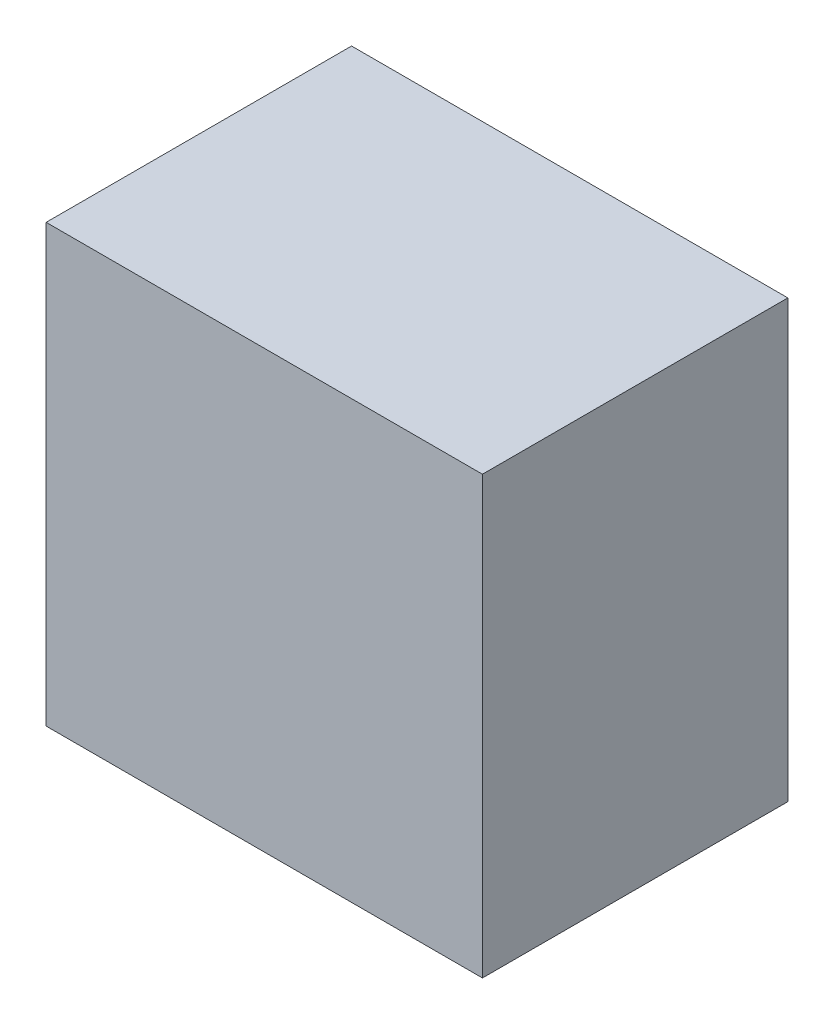
ISO-10303-21;
HEADER;
FILE_DESCRIPTION(('STEP AP214'),'2;1');
FILE_NAME('part.step','',(''),(''),'','','');
FILE_SCHEMA(('AUTOMOTIVE_DESIGN { 1 0 10303 214 1 1 1 1 }'));
ENDSEC;
DATA;
#1=APPLICATION_CONTEXT('core data for automotive mechanical design processes');
#2=APPLICATION_PROTOCOL_DEFINITION('international standard','automotive_design',2000,#1);
#3=PRODUCT_CONTEXT('',#1,'mechanical');
#4=PRODUCT('Part','Part','',(#3));
#5=PRODUCT_RELATED_PRODUCT_CATEGORY('part','',(#4));
#6=PRODUCT_DEFINITION_FORMATION('','',#4);
#7=PRODUCT_DEFINITION_CONTEXT('part definition',#1,'design');
#8=PRODUCT_DEFINITION('design','',#6,#7);
#9=PRODUCT_DEFINITION_SHAPE('','',#8);
#10=(LENGTH_UNIT() NAMED_UNIT(*) SI_UNIT(.MILLI.,.METRE.));
#11=(NAMED_UNIT(*) PLANE_ANGLE_UNIT() SI_UNIT($,.RADIAN.));
#12=(NAMED_UNIT(*) SI_UNIT($,.STERADIAN.) SOLID_ANGLE_UNIT());
#13=UNCERTAINTY_MEASURE_WITH_UNIT(LENGTH_MEASURE(1.E-05),#10,'distance_accuracy_value','');
#14=(GEOMETRIC_REPRESENTATION_CONTEXT(3) GLOBAL_UNCERTAINTY_ASSIGNED_CONTEXT((#13)) GLOBAL_UNIT_ASSIGNED_CONTEXT((#10,
#11,#12)) REPRESENTATION_CONTEXT('',''));
#15=CARTESIAN_POINT('',(0.,0.,0.));
#16=DIRECTION('',(0.,0.,1.));
#17=DIRECTION('',(1.,0.,0.));
#18=AXIS2_PLACEMENT_3D('',#15,#16,#17);
#19=CARTESIAN_POINT('',(-0.2499995,-0.2499995,0.3499993));
#20=DIRECTION('',(0.,0.,-1.));
#21=DIRECTION('',(-1.,0.,0.));
#22=AXIS2_PLACEMENT_3D('',#19,#20,#21);
#23=PLANE('',#22);
#24=DIRECTION('',(0.,1.,0.));
#25=VECTOR('',#24,1.);
#26=CARTESIAN_POINT('',(0.2499995,-0.2499995,0.3499993));
#27=LINE('',#26,#25);
#28=CARTESIAN_POINT('',(0.2499995,-0.2499995,0.3499993));
#29=VERTEX_POINT('',#28);
#30=CARTESIAN_POINT('',(0.2499995,0.25000204,0.3499993));
#31=VERTEX_POINT('',#30);
#32=EDGE_CURVE('E55',#29,#31,#27,.T.);
#33=ORIENTED_EDGE('',*,*,#32,.T.);
#34=DIRECTION('',(1.,0.,0.));
#35=VECTOR('',#34,1.);
#36=CARTESIAN_POINT('',(0.2499995,0.25000204,0.3499993));
#37=LINE('',#36,#35);
#38=CARTESIAN_POINT('',(-0.2499995,0.25000204,0.3499993));
#39=VERTEX_POINT('',#38);
#40=EDGE_CURVE('E57',#31,#39,#37,.F.);
#41=ORIENTED_EDGE('',*,*,#40,.T.);
#42=DIRECTION('',(0.,1.,0.));
#43=VECTOR('',#42,1.);
#44=CARTESIAN_POINT('',(-0.2499995,0.25000204,0.3499993));
#45=LINE('',#44,#43);
#46=CARTESIAN_POINT('',(-0.2499995,-0.2499995,0.3499993));
#47=VERTEX_POINT('',#46);
#48=EDGE_CURVE('E20',#39,#47,#45,.F.);
#49=ORIENTED_EDGE('',*,*,#48,.T.);
#50=DIRECTION('',(1.,0.,0.));
#51=VECTOR('',#50,1.);
#52=CARTESIAN_POINT('',(-0.2499995,-0.2499995,0.3499993));
#53=LINE('',#52,#51);
#54=EDGE_CURVE('E80',#47,#29,#53,.T.);
#55=ORIENTED_EDGE('',*,*,#54,.T.);
#56=EDGE_LOOP('',(#33,#41,#49,#55));
#57=FACE_BOUND('',#56,.T.);
#58=ADVANCED_FACE('F17',(#57),#23,.F.);
#59=CARTESIAN_POINT('',(-0.2499995,0.25000204,0.));
#60=DIRECTION('',(1.,0.,0.));
#61=DIRECTION('',(0.,0.,-1.));
#62=AXIS2_PLACEMENT_3D('',#59,#60,#61);
#63=PLANE('',#62);
#64=DIRECTION('',(0.,0.,1.));
#65=VECTOR('',#64,1.);
#66=CARTESIAN_POINT('',(-0.2499995,-0.2499995,0.));
#67=LINE('',#66,#65);
#68=CARTESIAN_POINT('',(-0.2499995,-0.2499995,0.));
#69=VERTEX_POINT('',#68);
#70=EDGE_CURVE('E68',#69,#47,#67,.T.);
#71=ORIENTED_EDGE('',*,*,#70,.T.);
#72=ORIENTED_EDGE('',*,*,#48,.F.);
#73=DIRECTION('',(0.,0.,-1.));
#74=VECTOR('',#73,1.);
#75=CARTESIAN_POINT('',(-0.2499995,0.25000204,0.));
#76=LINE('',#75,#74);
#77=CARTESIAN_POINT('',(-0.2499995,0.25000204,0.));
#78=VERTEX_POINT('',#77);
#79=EDGE_CURVE('E63',#39,#78,#76,.T.);
#80=ORIENTED_EDGE('',*,*,#79,.T.);
#81=DIRECTION('',(0.,1.,0.));
#82=VECTOR('',#81,1.);
#83=CARTESIAN_POINT('',(-0.2499995,-0.2499995,0.));
#84=LINE('',#83,#82);
#85=EDGE_CURVE('E83',#69,#78,#84,.T.);
#86=ORIENTED_EDGE('',*,*,#85,.F.);
#87=EDGE_LOOP('',(#71,#72,#80,#86));
#88=FACE_BOUND('',#87,.T.);
#89=ADVANCED_FACE('F65',(#88),#63,.F.);
#90=CARTESIAN_POINT('',(0.2499995,0.25000204,0.));
#91=DIRECTION('',(0.,-1.,0.));
#92=DIRECTION('',(0.,0.,-1.));
#93=AXIS2_PLACEMENT_3D('',#90,#91,#92);
#94=PLANE('',#93);
#95=ORIENTED_EDGE('',*,*,#79,.F.);
#96=ORIENTED_EDGE('',*,*,#40,.F.);
#97=DIRECTION('',(0.,0.,1.));
#98=VECTOR('',#97,1.);
#99=CARTESIAN_POINT('',(0.2499995,0.25000204,0.));
#100=LINE('',#99,#98);
#101=CARTESIAN_POINT('',(0.2499995,0.25000204,0.));
#102=VERTEX_POINT('',#101);
#103=EDGE_CURVE('E75',#31,#102,#100,.F.);
#104=ORIENTED_EDGE('',*,*,#103,.T.);
#105=DIRECTION('',(-1.,0.,0.));
#106=VECTOR('',#105,1.);
#107=CARTESIAN_POINT('',(-0.2499995,0.25000204,0.));
#108=LINE('',#107,#106);
#109=EDGE_CURVE('E72',#78,#102,#108,.F.);
#110=ORIENTED_EDGE('',*,*,#109,.F.);
#111=EDGE_LOOP('',(#95,#96,#104,#110));
#112=FACE_BOUND('',#111,.T.);
#113=ADVANCED_FACE('F70',(#112),#94,.F.);
#114=CARTESIAN_POINT('',(0.2499995,-0.2499995,0.));
#115=DIRECTION('',(-1.,0.,0.));
#116=DIRECTION('',(0.,0.,1.));
#117=AXIS2_PLACEMENT_3D('',#114,#115,#116);
#118=PLANE('',#117);
#119=ORIENTED_EDGE('',*,*,#103,.F.);
#120=ORIENTED_EDGE('',*,*,#32,.F.);
#121=DIRECTION('',(0.,0.,1.));
#122=VECTOR('',#121,1.);
#123=CARTESIAN_POINT('',(0.2499995,-0.2499995,0.));
#124=LINE('',#123,#122);
#125=CARTESIAN_POINT('',(0.2499995,-0.2499995,0.));
#126=VERTEX_POINT('',#125);
#127=EDGE_CURVE('E35',#29,#126,#124,.F.);
#128=ORIENTED_EDGE('',*,*,#127,.T.);
#129=DIRECTION('',(0.,1.,0.));
#130=VECTOR('',#129,1.);
#131=CARTESIAN_POINT('',(0.2499995,-0.2499995,0.));
#132=LINE('',#131,#130);
#133=EDGE_CURVE('E26',#102,#126,#132,.F.);
#134=ORIENTED_EDGE('',*,*,#133,.F.);
#135=EDGE_LOOP('',(#119,#120,#128,#134));
#136=FACE_BOUND('',#135,.T.);
#137=ADVANCED_FACE('F89',(#136),#118,.F.);
#138=CARTESIAN_POINT('',(-0.2499995,-0.2499995,0.));
#139=DIRECTION('',(0.,1.,0.));
#140=DIRECTION('',(0.,0.,1.));
#141=AXIS2_PLACEMENT_3D('',#138,#139,#140);
#142=PLANE('',#141);
#143=ORIENTED_EDGE('',*,*,#127,.F.);
#144=ORIENTED_EDGE('',*,*,#54,.F.);
#145=ORIENTED_EDGE('',*,*,#70,.F.);
#146=DIRECTION('',(-1.,0.,0.));
#147=VECTOR('',#146,1.);
#148=CARTESIAN_POINT('',(-0.2499995,-0.2499995,0.));
#149=LINE('',#148,#147);
#150=EDGE_CURVE('E11',#126,#69,#149,.T.);
#151=ORIENTED_EDGE('',*,*,#150,.F.);
#152=EDGE_LOOP('',(#143,#144,#145,#151));
#153=FACE_BOUND('',#152,.T.);
#154=ADVANCED_FACE('F91',(#153),#142,.F.);
#155=CARTESIAN_POINT('',(-0.2499995,-0.2499995,0.));
#156=DIRECTION('',(0.,0.,-1.));
#157=DIRECTION('',(-1.,0.,0.));
#158=AXIS2_PLACEMENT_3D('',#155,#156,#157);
#159=PLANE('',#158);
#160=ORIENTED_EDGE('',*,*,#133,.T.);
#161=ORIENTED_EDGE('',*,*,#150,.T.);
#162=ORIENTED_EDGE('',*,*,#85,.T.);
#163=ORIENTED_EDGE('',*,*,#109,.T.);
#164=EDGE_LOOP('',(#160,#161,#162,#163));
#165=FACE_BOUND('',#164,.T.);
#166=ADVANCED_FACE('F88',(#165),#159,.T.);
#167=CLOSED_SHELL('',(#58,#89,#113,#137,#154,#166));
#168=MANIFOLD_SOLID_BREP('B1',#167);
#169=ADVANCED_BREP_SHAPE_REPRESENTATION('',(#18,#168),#14);
#170=SHAPE_DEFINITION_REPRESENTATION(#9,#169);
ENDSEC;
END-ISO-10303-21;
